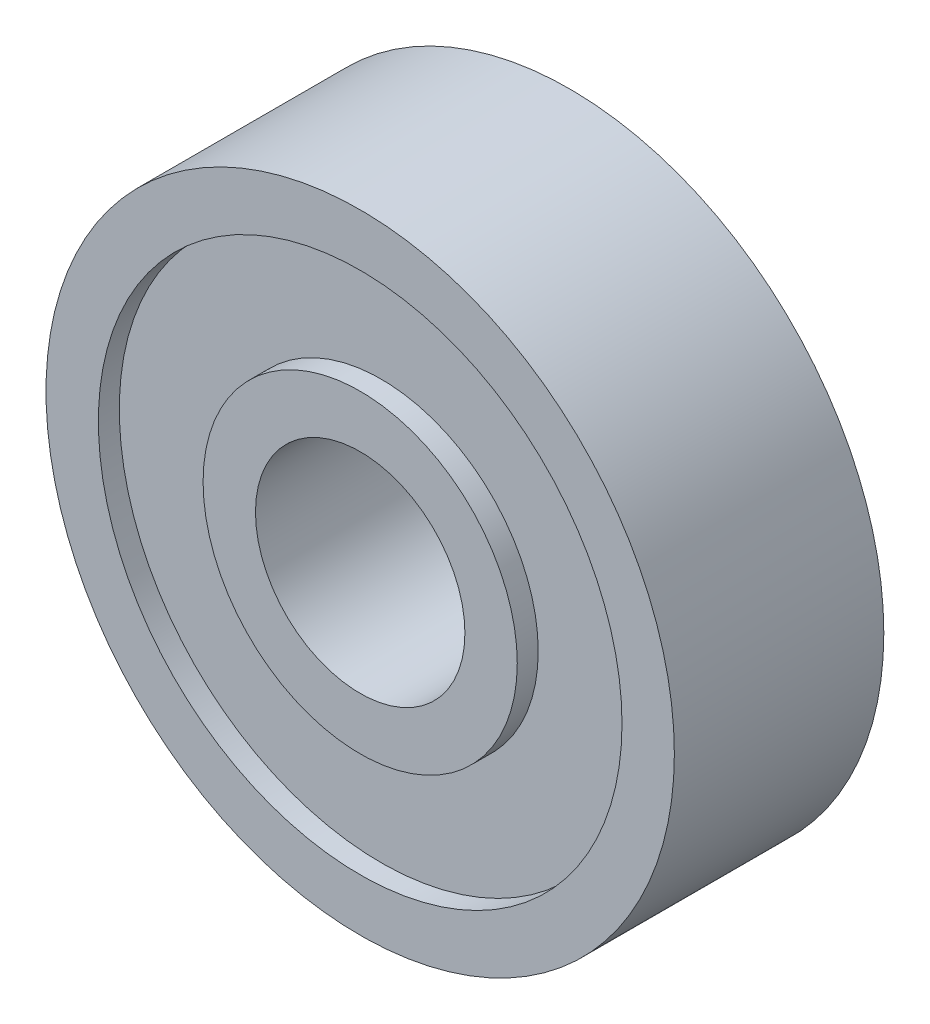
ISO-10303-21;
HEADER;
FILE_DESCRIPTION(('STEP AP214'),'2;1');
FILE_NAME('part.step','',(''),(''),'','','');
FILE_SCHEMA(('AUTOMOTIVE_DESIGN { 1 0 10303 214 1 1 1 1 }'));
ENDSEC;
DATA;
#1=APPLICATION_CONTEXT('core data for automotive mechanical design processes');
#2=APPLICATION_PROTOCOL_DEFINITION('international standard','automotive_design',2000,#1);
#3=PRODUCT_CONTEXT('',#1,'mechanical');
#4=PRODUCT('Part','Part','',(#3));
#5=PRODUCT_RELATED_PRODUCT_CATEGORY('part','',(#4));
#6=PRODUCT_DEFINITION_FORMATION('','',#4);
#7=PRODUCT_DEFINITION_CONTEXT('part definition',#1,'design');
#8=PRODUCT_DEFINITION('design','',#6,#7);
#9=PRODUCT_DEFINITION_SHAPE('','',#8);
#10=(LENGTH_UNIT() NAMED_UNIT(*) SI_UNIT(.MILLI.,.METRE.));
#11=(NAMED_UNIT(*) PLANE_ANGLE_UNIT() SI_UNIT($,.RADIAN.));
#12=(NAMED_UNIT(*) SI_UNIT($,.STERADIAN.) SOLID_ANGLE_UNIT());
#13=UNCERTAINTY_MEASURE_WITH_UNIT(LENGTH_MEASURE(1.E-05),#10,'distance_accuracy_value','');
#14=(GEOMETRIC_REPRESENTATION_CONTEXT(3) GLOBAL_UNCERTAINTY_ASSIGNED_CONTEXT((#13)) GLOBAL_UNIT_ASSIGNED_CONTEXT((#10,
#11,#12)) REPRESENTATION_CONTEXT('',''));
#15=CARTESIAN_POINT('',(0.,0.,0.));
#16=DIRECTION('',(0.,0.,1.));
#17=DIRECTION('',(1.,0.,0.));
#18=AXIS2_PLACEMENT_3D('',#15,#16,#17);
#19=CARTESIAN_POINT('',(0.,0.,10.));
#20=DIRECTION('',(0.,0.,-1.));
#21=DIRECTION('',(-1.,0.,0.));
#22=AXIS2_PLACEMENT_3D('',#19,#20,#21);
#23=CYLINDRICAL_SURFACE('',#22,12.5);
#24=CARTESIAN_POINT('',(0.,0.,9.));
#25=DIRECTION('',(0.,0.,1.));
#26=DIRECTION('',(1.,0.,0.));
#27=AXIS2_PLACEMENT_3D('',#24,#25,#26);
#28=CIRCLE('',#27,12.5);
#29=CARTESIAN_POINT('',(12.5,0.,9.));
#30=VERTEX_POINT('',#29);
#31=EDGE_CURVE('E11',#30,#30,#28,.T.);
#32=ORIENTED_EDGE('',*,*,#31,.F.);
#33=EDGE_LOOP('',(#32));
#34=FACE_BOUND('',#33,.T.);
#35=CARTESIAN_POINT('',(0.,0.,10.));
#36=DIRECTION('',(0.,0.,1.));
#37=DIRECTION('',(1.,0.,0.));
#38=AXIS2_PLACEMENT_3D('',#35,#36,#37);
#39=CIRCLE('',#38,12.5);
#40=CARTESIAN_POINT('',(12.5,0.,10.));
#41=VERTEX_POINT('',#40);
#42=EDGE_CURVE('E56',#41,#41,#39,.T.);
#43=ORIENTED_EDGE('',*,*,#42,.T.);
#44=EDGE_LOOP('',(#43));
#45=FACE_BOUND('',#44,.T.);
#46=ADVANCED_FACE('F44',(#34,#45),#23,.F.);
#47=CARTESIAN_POINT('',(0.,0.,10.));
#48=DIRECTION('',(0.,0.,-1.));
#49=DIRECTION('',(-1.,0.,0.));
#50=AXIS2_PLACEMENT_3D('',#47,#48,#49);
#51=CYLINDRICAL_SURFACE('',#50,15.);
#52=CARTESIAN_POINT('',(0.,0.,10.));
#53=DIRECTION('',(0.,0.,1.));
#54=DIRECTION('',(1.,0.,0.));
#55=AXIS2_PLACEMENT_3D('',#52,#53,#54);
#56=CIRCLE('',#55,15.);
#57=CARTESIAN_POINT('',(15.,0.,10.));
#58=VERTEX_POINT('',#57);
#59=EDGE_CURVE('E51',#58,#58,#56,.T.);
#60=ORIENTED_EDGE('',*,*,#59,.F.);
#61=EDGE_LOOP('',(#60));
#62=FACE_BOUND('',#61,.T.);
#63=CARTESIAN_POINT('',(0.,0.,0.));
#64=DIRECTION('',(0.,0.,1.));
#65=DIRECTION('',(1.,0.,0.));
#66=AXIS2_PLACEMENT_3D('',#63,#64,#65);
#67=CIRCLE('',#66,15.);
#68=CARTESIAN_POINT('',(15.,0.,0.));
#69=VERTEX_POINT('',#68);
#70=EDGE_CURVE('E62',#69,#69,#67,.T.);
#71=ORIENTED_EDGE('',*,*,#70,.T.);
#72=EDGE_LOOP('',(#71));
#73=FACE_BOUND('',#72,.T.);
#74=ADVANCED_FACE('F106',(#62,#73),#51,.T.);
#75=CARTESIAN_POINT('',(0.,0.,10.));
#76=DIRECTION('',(0.,0.,1.));
#77=DIRECTION('',(1.,0.,0.));
#78=AXIS2_PLACEMENT_3D('',#75,#76,#77);
#79=PLANE('',#78);
#80=ORIENTED_EDGE('',*,*,#42,.F.);
#81=EDGE_LOOP('',(#80));
#82=FACE_BOUND('',#81,.T.);
#83=ORIENTED_EDGE('',*,*,#59,.T.);
#84=EDGE_LOOP('',(#83));
#85=FACE_BOUND('',#84,.T.);
#86=ADVANCED_FACE('F111',(#82,#85),#79,.T.);
#87=CARTESIAN_POINT('',(0.,0.,0.));
#88=DIRECTION('',(0.,0.,1.));
#89=DIRECTION('',(1.,0.,0.));
#90=AXIS2_PLACEMENT_3D('',#87,#88,#89);
#91=PLANE('',#90);
#92=ORIENTED_EDGE('',*,*,#70,.F.);
#93=EDGE_LOOP('',(#92));
#94=FACE_BOUND('',#93,.T.);
#95=CARTESIAN_POINT('',(0.,0.,0.));
#96=DIRECTION('',(0.,0.,1.));
#97=DIRECTION('',(1.,0.,0.));
#98=AXIS2_PLACEMENT_3D('',#95,#96,#97);
#99=CIRCLE('',#98,5.);
#100=CARTESIAN_POINT('',(5.,0.,0.));
#101=VERTEX_POINT('',#100);
#102=EDGE_CURVE('E80',#101,#101,#99,.T.);
#103=ORIENTED_EDGE('',*,*,#102,.T.);
#104=EDGE_LOOP('',(#103));
#105=FACE_BOUND('',#104,.T.);
#106=ADVANCED_FACE('F117',(#94,#105),#91,.F.);
#107=CARTESIAN_POINT('',(0.,0.,9.));
#108=DIRECTION('',(0.,0.,1.));
#109=DIRECTION('',(1.,0.,0.));
#110=AXIS2_PLACEMENT_3D('',#107,#108,#109);
#111=PLANE('',#110);
#112=CARTESIAN_POINT('',(0.,0.,9.));
#113=DIRECTION('',(0.,0.,1.));
#114=DIRECTION('',(1.,0.,0.));
#115=AXIS2_PLACEMENT_3D('',#112,#113,#114);
#116=CIRCLE('',#115,7.5);
#117=CARTESIAN_POINT('',(7.5,0.,9.));
#118=VERTEX_POINT('',#117);
#119=EDGE_CURVE('E67',#118,#118,#116,.T.);
#120=ORIENTED_EDGE('',*,*,#119,.F.);
#121=EDGE_LOOP('',(#120));
#122=FACE_BOUND('',#121,.T.);
#123=ORIENTED_EDGE('',*,*,#31,.T.);
#124=EDGE_LOOP('',(#123));
#125=FACE_BOUND('',#124,.T.);
#126=ADVANCED_FACE('F103',(#122,#125),#111,.T.);
#127=CARTESIAN_POINT('',(0.,0.,10.));
#128=DIRECTION('',(0.,0.,-1.));
#129=DIRECTION('',(-1.,0.,0.));
#130=AXIS2_PLACEMENT_3D('',#127,#128,#129);
#131=CYLINDRICAL_SURFACE('',#130,5.);
#132=CARTESIAN_POINT('',(0.,0.,10.));
#133=DIRECTION('',(0.,0.,1.));
#134=DIRECTION('',(1.,0.,0.));
#135=AXIS2_PLACEMENT_3D('',#132,#133,#134);
#136=CIRCLE('',#135,5.);
#137=CARTESIAN_POINT('',(5.,0.,10.));
#138=VERTEX_POINT('',#137);
#139=EDGE_CURVE('E77',#138,#138,#136,.T.);
#140=ORIENTED_EDGE('',*,*,#139,.T.);
#141=EDGE_LOOP('',(#140));
#142=FACE_BOUND('',#141,.T.);
#143=ORIENTED_EDGE('',*,*,#102,.F.);
#144=EDGE_LOOP('',(#143));
#145=FACE_BOUND('',#144,.T.);
#146=ADVANCED_FACE('F88',(#142,#145),#131,.F.);
#147=CARTESIAN_POINT('',(0.,0.,10.));
#148=DIRECTION('',(0.,0.,-1.));
#149=DIRECTION('',(-1.,0.,0.));
#150=AXIS2_PLACEMENT_3D('',#147,#148,#149);
#151=CYLINDRICAL_SURFACE('',#150,7.5);
#152=ORIENTED_EDGE('',*,*,#119,.T.);
#153=EDGE_LOOP('',(#152));
#154=FACE_BOUND('',#153,.T.);
#155=CARTESIAN_POINT('',(0.,0.,10.));
#156=DIRECTION('',(0.,0.,1.));
#157=DIRECTION('',(1.,0.,0.));
#158=AXIS2_PLACEMENT_3D('',#155,#156,#157);
#159=CIRCLE('',#158,7.5);
#160=CARTESIAN_POINT('',(7.5,0.,10.));
#161=VERTEX_POINT('',#160);
#162=EDGE_CURVE('E72',#161,#161,#159,.T.);
#163=ORIENTED_EDGE('',*,*,#162,.F.);
#164=EDGE_LOOP('',(#163));
#165=FACE_BOUND('',#164,.T.);
#166=ADVANCED_FACE('F94',(#154,#165),#151,.T.);
#167=CARTESIAN_POINT('',(0.,0.,10.));
#168=DIRECTION('',(0.,0.,1.));
#169=DIRECTION('',(1.,0.,0.));
#170=AXIS2_PLACEMENT_3D('',#167,#168,#169);
#171=PLANE('',#170);
#172=ORIENTED_EDGE('',*,*,#139,.F.);
#173=EDGE_LOOP('',(#172));
#174=FACE_BOUND('',#173,.T.);
#175=ORIENTED_EDGE('',*,*,#162,.T.);
#176=EDGE_LOOP('',(#175));
#177=FACE_BOUND('',#176,.T.);
#178=ADVANCED_FACE('F91',(#174,#177),#171,.T.);
#179=CLOSED_SHELL('',(#46,#74,#86,#106,#126,#146,#166,#178));
#180=MANIFOLD_SOLID_BREP('B2',#179);
#181=ADVANCED_BREP_SHAPE_REPRESENTATION('',(#18,#180),#14);
#182=SHAPE_DEFINITION_REPRESENTATION(#9,#181);
ENDSEC;
END-ISO-10303-21;
